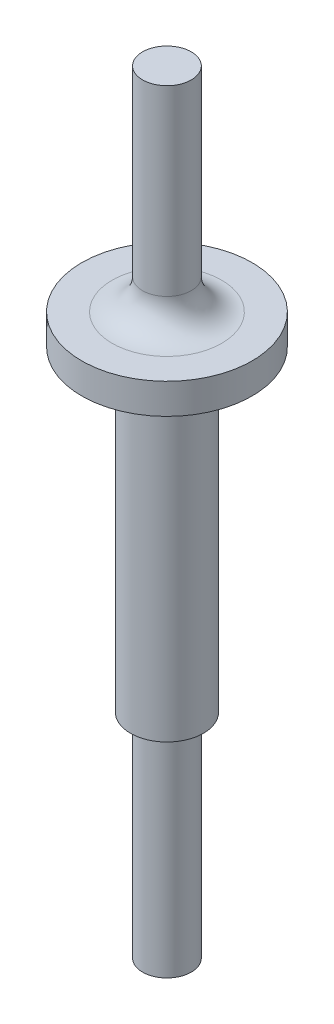
ISO-10303-21;
HEADER;
FILE_DESCRIPTION(('STEP AP214'),'2;1');
FILE_NAME('part.step','',(''),(''),'','','');
FILE_SCHEMA(('AUTOMOTIVE_DESIGN { 1 0 10303 214 1 1 1 1 }'));
ENDSEC;
DATA;
#1=APPLICATION_CONTEXT('core data for automotive mechanical design processes');
#2=APPLICATION_PROTOCOL_DEFINITION('international standard','automotive_design',2000,#1);
#3=PRODUCT_CONTEXT('',#1,'mechanical');
#4=PRODUCT('Part','Part','',(#3));
#5=PRODUCT_RELATED_PRODUCT_CATEGORY('part','',(#4));
#6=PRODUCT_DEFINITION_FORMATION('','',#4);
#7=PRODUCT_DEFINITION_CONTEXT('part definition',#1,'design');
#8=PRODUCT_DEFINITION('design','',#6,#7);
#9=PRODUCT_DEFINITION_SHAPE('','',#8);
#10=(LENGTH_UNIT() NAMED_UNIT(*) SI_UNIT(.MILLI.,.METRE.));
#11=(NAMED_UNIT(*) PLANE_ANGLE_UNIT() SI_UNIT($,.RADIAN.));
#12=(NAMED_UNIT(*) SI_UNIT($,.STERADIAN.) SOLID_ANGLE_UNIT());
#13=UNCERTAINTY_MEASURE_WITH_UNIT(LENGTH_MEASURE(1.E-05),#10,'distance_accuracy_value','');
#14=(GEOMETRIC_REPRESENTATION_CONTEXT(3) GLOBAL_UNCERTAINTY_ASSIGNED_CONTEXT((#13)) GLOBAL_UNIT_ASSIGNED_CONTEXT((#10,
#11,#12)) REPRESENTATION_CONTEXT('',''));
#15=CARTESIAN_POINT('',(0.,0.,0.));
#16=DIRECTION('',(0.,0.,1.));
#17=DIRECTION('',(1.,0.,0.));
#18=AXIS2_PLACEMENT_3D('',#15,#16,#17);
#19=CARTESIAN_POINT('',(2.17821808079139,-30.9279483645654,0.));
#20=DIRECTION('',(0.,-1.,0.));
#21=DIRECTION('',(1.,0.,0.));
#22=AXIS2_PLACEMENT_3D('',#19,#20,#21);
#23=TOROIDAL_SURFACE('',#22,5.4142135623731,1.4142135623731);
#24=CARTESIAN_POINT('',(2.17821808079139,-29.5137348021923,0.));
#25=DIRECTION('',(0.,1.,0.));
#26=DIRECTION('',(-1.,0.,0.));
#27=AXIS2_PLACEMENT_3D('',#24,#25,#26);
#28=CIRCLE('',#27,5.4142135623731);
#29=CARTESIAN_POINT('',(-3.23599548158171,-29.5137348021923,0.));
#30=VERTEX_POINT('',#29);
#31=EDGE_CURVE('E37',#30,#30,#28,.T.);
#32=ORIENTED_EDGE('',*,*,#31,.F.);
#33=EDGE_LOOP('',(#32));
#34=FACE_BOUND('',#33,.T.);
#35=CARTESIAN_POINT('',(2.17821808079139,-30.9279483645654,0.));
#36=DIRECTION('',(0.,-1.,0.));
#37=DIRECTION('',(1.,0.,0.));
#38=AXIS2_PLACEMENT_3D('',#35,#36,#37);
#39=CIRCLE('',#38,4.);
#40=CARTESIAN_POINT('',(6.17821808079139,-30.9279483645654,0.));
#41=VERTEX_POINT('',#40);
#42=EDGE_CURVE('E10',#41,#41,#39,.T.);
#43=ORIENTED_EDGE('',*,*,#42,.F.);
#44=EDGE_LOOP('',(#43));
#45=FACE_BOUND('',#44,.T.);
#46=ADVANCED_FACE('F31',(#34,#45),#23,.F.);
#47=CARTESIAN_POINT('',(2.17821808079138,20.4862651978077,0.));
#48=DIRECTION('',(0.,1.,0.));
#49=DIRECTION('',(-1.,0.,0.));
#50=AXIS2_PLACEMENT_3D('',#47,#48,#49);
#51=TOROIDAL_SURFACE('',#50,8.,2.);
#52=CARTESIAN_POINT('',(2.17821808079138,22.4862651978077,0.));
#53=DIRECTION('',(0.,1.,0.));
#54=DIRECTION('',(-1.,0.,0.));
#55=AXIS2_PLACEMENT_3D('',#52,#53,#54);
#56=CIRCLE('',#55,8.);
#57=CARTESIAN_POINT('',(-5.82178191920862,22.4862651978077,0.));
#58=VERTEX_POINT('',#57);
#59=EDGE_CURVE('E45',#58,#58,#56,.T.);
#60=ORIENTED_EDGE('',*,*,#59,.F.);
#61=EDGE_LOOP('',(#60));
#62=FACE_BOUND('',#61,.T.);
#63=CARTESIAN_POINT('',(2.17821808079138,20.4862651978077,0.));
#64=DIRECTION('',(0.,1.,0.));
#65=DIRECTION('',(-1.,0.,0.));
#66=AXIS2_PLACEMENT_3D('',#63,#64,#65);
#67=CIRCLE('',#66,6.);
#68=CARTESIAN_POINT('',(-3.82178191920862,20.4862651978077,0.));
#69=VERTEX_POINT('',#68);
#70=EDGE_CURVE('E41',#69,#69,#67,.F.);
#71=ORIENTED_EDGE('',*,*,#70,.F.);
#72=EDGE_LOOP('',(#71));
#73=FACE_BOUND('',#72,.T.);
#74=ADVANCED_FACE('F86',(#62,#73),#51,.F.);
#75=CARTESIAN_POINT('',(2.17821808079138,32.4862651978077,0.));
#76=DIRECTION('',(0.,-1.,0.));
#77=DIRECTION('',(1.,0.,0.));
#78=AXIS2_PLACEMENT_3D('',#75,#76,#77);
#79=TOROIDAL_SURFACE('',#78,9.,5.);
#80=CARTESIAN_POINT('',(2.17821808079138,27.4862651978077,0.));
#81=DIRECTION('',(0.,-1.,0.));
#82=DIRECTION('',(1.,0.,0.));
#83=AXIS2_PLACEMENT_3D('',#80,#81,#82);
#84=CIRCLE('',#83,9.);
#85=CARTESIAN_POINT('',(11.1782180807914,27.4862651978077,0.));
#86=VERTEX_POINT('',#85);
#87=EDGE_CURVE('E53',#86,#86,#84,.T.);
#88=ORIENTED_EDGE('',*,*,#87,.F.);
#89=EDGE_LOOP('',(#88));
#90=FACE_BOUND('',#89,.T.);
#91=CARTESIAN_POINT('',(2.17821808079138,32.4862651978077,0.));
#92=DIRECTION('',(0.,-1.,0.));
#93=DIRECTION('',(1.,0.,0.));
#94=AXIS2_PLACEMENT_3D('',#91,#92,#93);
#95=CIRCLE('',#94,4.);
#96=CARTESIAN_POINT('',(6.17821808079138,32.4862651978077,0.));
#97=VERTEX_POINT('',#96);
#98=EDGE_CURVE('E50',#97,#97,#95,.F.);
#99=ORIENTED_EDGE('',*,*,#98,.F.);
#100=EDGE_LOOP('',(#99));
#101=FACE_BOUND('',#100,.T.);
#102=ADVANCED_FACE('F91',(#90,#101),#79,.F.);
#103=CARTESIAN_POINT('',(6.17821808079138,62.4862651978077,0.));
#104=DIRECTION('',(0.,-1.,0.));
#105=DIRECTION('',(1.,0.,0.));
#106=AXIS2_PLACEMENT_3D('',#103,#104,#105);
#107=PLANE('',#106);
#108=CARTESIAN_POINT('',(2.17821808079138,62.4862651978077,0.));
#109=DIRECTION('',(0.,1.,0.));
#110=DIRECTION('',(-1.,0.,0.));
#111=AXIS2_PLACEMENT_3D('',#108,#109,#110);
#112=CIRCLE('',#111,4.);
#113=CARTESIAN_POINT('',(-1.82178191920862,62.4862651978077,0.));
#114=VERTEX_POINT('',#113);
#115=EDGE_CURVE('E68',#114,#114,#112,.T.);
#116=ORIENTED_EDGE('',*,*,#115,.T.);
#117=EDGE_LOOP('',(#116));
#118=FACE_BOUND('',#117,.T.);
#119=ADVANCED_FACE('F72',(#118),#107,.F.);
#120=CARTESIAN_POINT('',(2.17821808079139,-64.5137348021923,0.));
#121=DIRECTION('',(0.,1.,0.));
#122=DIRECTION('',(-1.,0.,0.));
#123=AXIS2_PLACEMENT_3D('',#120,#121,#122);
#124=PLANE('',#123);
#125=CARTESIAN_POINT('',(2.17821808079139,-64.5137348021923,0.));
#126=DIRECTION('',(0.,1.,0.));
#127=DIRECTION('',(-1.,0.,0.));
#128=AXIS2_PLACEMENT_3D('',#125,#126,#127);
#129=CIRCLE('',#128,4.);
#130=CARTESIAN_POINT('',(-1.82178191920861,-64.5137348021923,0.));
#131=VERTEX_POINT('',#130);
#132=EDGE_CURVE('E56',#131,#131,#129,.T.);
#133=ORIENTED_EDGE('',*,*,#132,.F.);
#134=EDGE_LOOP('',(#133));
#135=FACE_BOUND('',#134,.T.);
#136=ADVANCED_FACE('F104',(#135),#124,.F.);
#137=CARTESIAN_POINT('',(2.17821808079138,62.4862651978077,0.));
#138=DIRECTION('',(0.,1.,0.));
#139=DIRECTION('',(-1.,0.,0.));
#140=AXIS2_PLACEMENT_3D('',#137,#138,#139);
#141=CYLINDRICAL_SURFACE('',#140,4.);
#142=ORIENTED_EDGE('',*,*,#42,.T.);
#143=EDGE_LOOP('',(#142));
#144=FACE_BOUND('',#143,.T.);
#145=ORIENTED_EDGE('',*,*,#132,.T.);
#146=EDGE_LOOP('',(#145));
#147=FACE_BOUND('',#146,.T.);
#148=ADVANCED_FACE('F107',(#144,#147),#141,.T.);
#149=CARTESIAN_POINT('',(8.17821808079139,-29.5137348021923,0.));
#150=DIRECTION('',(0.,1.,0.));
#151=DIRECTION('',(-1.,0.,0.));
#152=AXIS2_PLACEMENT_3D('',#149,#150,#151);
#153=PLANE('',#152);
#154=ORIENTED_EDGE('',*,*,#31,.T.);
#155=EDGE_LOOP('',(#154));
#156=FACE_BOUND('',#155,.T.);
#157=CARTESIAN_POINT('',(2.17821808079139,-29.5137348021923,0.));
#158=DIRECTION('',(0.,1.,0.));
#159=DIRECTION('',(-1.,0.,0.));
#160=AXIS2_PLACEMENT_3D('',#157,#158,#159);
#161=CIRCLE('',#160,6.);
#162=CARTESIAN_POINT('',(-3.82178191920861,-29.5137348021923,0.));
#163=VERTEX_POINT('',#162);
#164=EDGE_CURVE('E59',#163,#163,#161,.T.);
#165=ORIENTED_EDGE('',*,*,#164,.F.);
#166=EDGE_LOOP('',(#165));
#167=FACE_BOUND('',#166,.T.);
#168=ADVANCED_FACE('F111',(#156,#167),#153,.F.);
#169=CARTESIAN_POINT('',(2.17821808079138,62.4862651978077,0.));
#170=DIRECTION('',(0.,1.,0.));
#171=DIRECTION('',(-1.,0.,0.));
#172=AXIS2_PLACEMENT_3D('',#169,#170,#171);
#173=CYLINDRICAL_SURFACE('',#172,6.);
#174=ORIENTED_EDGE('',*,*,#70,.T.);
#175=EDGE_LOOP('',(#174));
#176=FACE_BOUND('',#175,.T.);
#177=ORIENTED_EDGE('',*,*,#164,.T.);
#178=EDGE_LOOP('',(#177));
#179=FACE_BOUND('',#178,.T.);
#180=ADVANCED_FACE('F114',(#176,#179),#173,.T.);
#181=CARTESIAN_POINT('',(16.1782180807914,22.4862651978077,0.));
#182=DIRECTION('',(0.,1.,0.));
#183=DIRECTION('',(-1.,0.,0.));
#184=AXIS2_PLACEMENT_3D('',#181,#182,#183);
#185=PLANE('',#184);
#186=ORIENTED_EDGE('',*,*,#59,.T.);
#187=EDGE_LOOP('',(#186));
#188=FACE_BOUND('',#187,.T.);
#189=CARTESIAN_POINT('',(2.17821808079138,22.4862651978077,0.));
#190=DIRECTION('',(0.,1.,0.));
#191=DIRECTION('',(-1.,0.,0.));
#192=AXIS2_PLACEMENT_3D('',#189,#190,#191);
#193=CIRCLE('',#192,14.);
#194=CARTESIAN_POINT('',(-11.8217819192086,22.4862651978077,0.));
#195=VERTEX_POINT('',#194);
#196=EDGE_CURVE('E62',#195,#195,#193,.T.);
#197=ORIENTED_EDGE('',*,*,#196,.F.);
#198=EDGE_LOOP('',(#197));
#199=FACE_BOUND('',#198,.T.);
#200=ADVANCED_FACE('F117',(#188,#199),#185,.F.);
#201=CARTESIAN_POINT('',(2.17821808079138,62.4862651978077,0.));
#202=DIRECTION('',(0.,1.,0.));
#203=DIRECTION('',(-1.,0.,0.));
#204=AXIS2_PLACEMENT_3D('',#201,#202,#203);
#205=CYLINDRICAL_SURFACE('',#204,14.);
#206=CARTESIAN_POINT('',(2.17821808079138,27.4862651978077,0.));
#207=DIRECTION('',(0.,1.,0.));
#208=DIRECTION('',(-1.,0.,0.));
#209=AXIS2_PLACEMENT_3D('',#206,#207,#208);
#210=CIRCLE('',#209,14.);
#211=CARTESIAN_POINT('',(-11.8217819192086,27.4862651978077,0.));
#212=VERTEX_POINT('',#211);
#213=EDGE_CURVE('E65',#212,#212,#210,.T.);
#214=ORIENTED_EDGE('',*,*,#213,.F.);
#215=EDGE_LOOP('',(#214));
#216=FACE_BOUND('',#215,.T.);
#217=ORIENTED_EDGE('',*,*,#196,.T.);
#218=EDGE_LOOP('',(#217));
#219=FACE_BOUND('',#218,.T.);
#220=ADVANCED_FACE('F82',(#216,#219),#205,.T.);
#221=CARTESIAN_POINT('',(6.17821808079138,27.4862651978077,0.));
#222=DIRECTION('',(0.,-1.,0.));
#223=DIRECTION('',(1.,0.,0.));
#224=AXIS2_PLACEMENT_3D('',#221,#222,#223);
#225=PLANE('',#224);
#226=ORIENTED_EDGE('',*,*,#87,.T.);
#227=EDGE_LOOP('',(#226));
#228=FACE_BOUND('',#227,.T.);
#229=ORIENTED_EDGE('',*,*,#213,.T.);
#230=EDGE_LOOP('',(#229));
#231=FACE_BOUND('',#230,.T.);
#232=ADVANCED_FACE('F76',(#228,#231),#225,.F.);
#233=CARTESIAN_POINT('',(2.17821808079138,62.4862651978077,0.));
#234=DIRECTION('',(0.,1.,0.));
#235=DIRECTION('',(-1.,0.,0.));
#236=AXIS2_PLACEMENT_3D('',#233,#234,#235);
#237=CYLINDRICAL_SURFACE('',#236,4.);
#238=ORIENTED_EDGE('',*,*,#98,.T.);
#239=EDGE_LOOP('',(#238));
#240=FACE_BOUND('',#239,.T.);
#241=ORIENTED_EDGE('',*,*,#115,.F.);
#242=EDGE_LOOP('',(#241));
#243=FACE_BOUND('',#242,.T.);
#244=ADVANCED_FACE('F74',(#240,#243),#237,.T.);
#245=CLOSED_SHELL('',(#46,#74,#102,#119,#136,#148,#168,#180,#200,#220,#232,#244));
#246=MANIFOLD_SOLID_BREP('B2',#245);
#247=ADVANCED_BREP_SHAPE_REPRESENTATION('',(#18,#246),#14);
#248=SHAPE_DEFINITION_REPRESENTATION(#9,#247);
ENDSEC;
END-ISO-10303-21;
